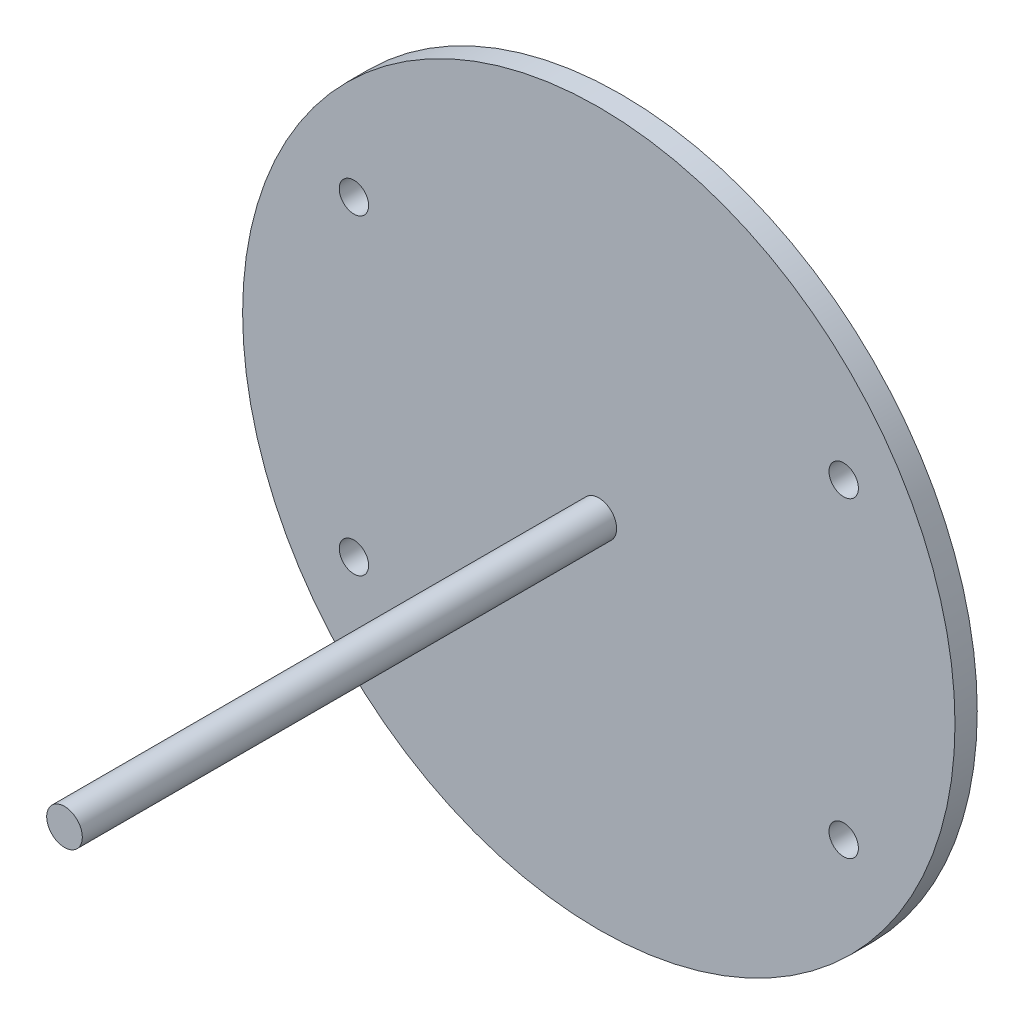
ISO-10303-21;
HEADER;
FILE_DESCRIPTION(('STEP AP214'),'2;1');
FILE_NAME('part.step','',(''),(''),'','','');
FILE_SCHEMA(('AUTOMOTIVE_DESIGN { 1 0 10303 214 1 1 1 1 }'));
ENDSEC;
DATA;
#1=APPLICATION_CONTEXT('core data for automotive mechanical design processes');
#2=APPLICATION_PROTOCOL_DEFINITION('international standard','automotive_design',2000,#1);
#3=PRODUCT_CONTEXT('',#1,'mechanical');
#4=PRODUCT('Part','Part','',(#3));
#5=PRODUCT_RELATED_PRODUCT_CATEGORY('part','',(#4));
#6=PRODUCT_DEFINITION_FORMATION('','',#4);
#7=PRODUCT_DEFINITION_CONTEXT('part definition',#1,'design');
#8=PRODUCT_DEFINITION('design','',#6,#7);
#9=PRODUCT_DEFINITION_SHAPE('','',#8);
#10=(LENGTH_UNIT() NAMED_UNIT(*) SI_UNIT(.MILLI.,.METRE.));
#11=(NAMED_UNIT(*) PLANE_ANGLE_UNIT() SI_UNIT($,.RADIAN.));
#12=(NAMED_UNIT(*) SI_UNIT($,.STERADIAN.) SOLID_ANGLE_UNIT());
#13=UNCERTAINTY_MEASURE_WITH_UNIT(LENGTH_MEASURE(1.E-05),#10,'distance_accuracy_value','');
#14=(GEOMETRIC_REPRESENTATION_CONTEXT(3) GLOBAL_UNCERTAINTY_ASSIGNED_CONTEXT((#13)) GLOBAL_UNIT_ASSIGNED_CONTEXT((#10,
#11,#12)) REPRESENTATION_CONTEXT('',''));
#15=CARTESIAN_POINT('',(0.,0.,0.));
#16=DIRECTION('',(0.,0.,1.));
#17=DIRECTION('',(1.,0.,0.));
#18=AXIS2_PLACEMENT_3D('',#15,#16,#17);
#19=CARTESIAN_POINT('',(0.,0.,2.5));
#20=DIRECTION('',(0.,0.,1.));
#21=DIRECTION('',(1.,0.,0.));
#22=AXIS2_PLACEMENT_3D('',#19,#20,#21);
#23=PLANE('',#22);
#24=CARTESIAN_POINT('',(0.,0.,2.5));
#25=DIRECTION('',(0.,0.,1.));
#26=DIRECTION('',(1.,0.,0.));
#27=AXIS2_PLACEMENT_3D('',#24,#25,#26);
#28=CIRCLE('',#27,2.);
#29=CARTESIAN_POINT('',(2.,0.,2.5));
#30=VERTEX_POINT('',#29);
#31=EDGE_CURVE('E84',#30,#30,#28,.T.);
#32=ORIENTED_EDGE('',*,*,#31,.F.);
#33=EDGE_LOOP('',(#32));
#34=FACE_BOUND('',#33,.T.);
#35=CARTESIAN_POINT('',(27.5,-17.5,2.5));
#36=DIRECTION('',(0.,0.,1.));
#37=DIRECTION('',(1.,0.,0.));
#38=AXIS2_PLACEMENT_3D('',#35,#36,#37);
#39=CIRCLE('',#38,1.65);
#40=CARTESIAN_POINT('',(29.15,-17.5,2.5));
#41=VERTEX_POINT('',#40);
#42=EDGE_CURVE('E64',#41,#41,#39,.T.);
#43=ORIENTED_EDGE('',*,*,#42,.F.);
#44=EDGE_LOOP('',(#43));
#45=FACE_BOUND('',#44,.T.);
#46=CARTESIAN_POINT('',(-27.5,17.5,2.5));
#47=DIRECTION('',(0.,0.,1.));
#48=DIRECTION('',(1.,0.,0.));
#49=AXIS2_PLACEMENT_3D('',#46,#47,#48);
#50=CIRCLE('',#49,1.65);
#51=CARTESIAN_POINT('',(-25.85,17.5,2.5));
#52=VERTEX_POINT('',#51);
#53=EDGE_CURVE('E50',#52,#52,#50,.T.);
#54=ORIENTED_EDGE('',*,*,#53,.F.);
#55=EDGE_LOOP('',(#54));
#56=FACE_BOUND('',#55,.T.);
#57=CARTESIAN_POINT('',(0.,0.,2.5));
#58=DIRECTION('',(0.,0.,1.));
#59=DIRECTION('',(1.,0.,0.));
#60=AXIS2_PLACEMENT_3D('',#57,#58,#59);
#61=CIRCLE('',#60,40.);
#62=CARTESIAN_POINT('',(40.,0.,2.5));
#63=VERTEX_POINT('',#62);
#64=EDGE_CURVE('E10',#63,#63,#61,.T.);
#65=ORIENTED_EDGE('',*,*,#64,.T.);
#66=EDGE_LOOP('',(#65));
#67=FACE_BOUND('',#66,.T.);
#68=CARTESIAN_POINT('',(27.5,17.5,2.5));
#69=DIRECTION('',(0.,0.,1.));
#70=DIRECTION('',(1.,0.,0.));
#71=AXIS2_PLACEMENT_3D('',#68,#69,#70);
#72=CIRCLE('',#71,1.65);
#73=CARTESIAN_POINT('',(29.15,17.5,2.5));
#74=VERTEX_POINT('',#73);
#75=EDGE_CURVE('E56',#74,#74,#72,.T.);
#76=ORIENTED_EDGE('',*,*,#75,.F.);
#77=EDGE_LOOP('',(#76));
#78=FACE_BOUND('',#77,.T.);
#79=CARTESIAN_POINT('',(-27.5,-17.5,2.5));
#80=DIRECTION('',(0.,0.,1.));
#81=DIRECTION('',(1.,0.,0.));
#82=AXIS2_PLACEMENT_3D('',#79,#80,#81);
#83=CIRCLE('',#82,1.65);
#84=CARTESIAN_POINT('',(-25.85,-17.5,2.5));
#85=VERTEX_POINT('',#84);
#86=EDGE_CURVE('E72',#85,#85,#83,.T.);
#87=ORIENTED_EDGE('',*,*,#86,.F.);
#88=EDGE_LOOP('',(#87));
#89=FACE_BOUND('',#88,.T.);
#90=ADVANCED_FACE('F37',(#34,#45,#56,#67,#78,#89),#23,.T.);
#91=CARTESIAN_POINT('',(0.,0.,0.));
#92=DIRECTION('',(0.,0.,1.));
#93=DIRECTION('',(1.,0.,0.));
#94=AXIS2_PLACEMENT_3D('',#91,#92,#93);
#95=PLANE('',#94);
#96=CARTESIAN_POINT('',(0.,0.,0.));
#97=DIRECTION('',(0.,0.,1.));
#98=DIRECTION('',(1.,0.,0.));
#99=AXIS2_PLACEMENT_3D('',#96,#97,#98);
#100=CIRCLE('',#99,40.);
#101=CARTESIAN_POINT('',(40.,0.,0.));
#102=VERTEX_POINT('',#101);
#103=EDGE_CURVE('E41',#102,#102,#100,.T.);
#104=ORIENTED_EDGE('',*,*,#103,.F.);
#105=EDGE_LOOP('',(#104));
#106=FACE_BOUND('',#105,.T.);
#107=CARTESIAN_POINT('',(-27.5,17.5,0.));
#108=DIRECTION('',(0.,0.,1.));
#109=DIRECTION('',(1.,0.,0.));
#110=AXIS2_PLACEMENT_3D('',#107,#108,#109);
#111=CIRCLE('',#110,1.65);
#112=CARTESIAN_POINT('',(-25.85,17.5,0.));
#113=VERTEX_POINT('',#112);
#114=EDGE_CURVE('E52',#113,#113,#111,.T.);
#115=ORIENTED_EDGE('',*,*,#114,.T.);
#116=EDGE_LOOP('',(#115));
#117=FACE_BOUND('',#116,.T.);
#118=CARTESIAN_POINT('',(27.5,17.5,0.));
#119=DIRECTION('',(0.,0.,1.));
#120=DIRECTION('',(1.,0.,0.));
#121=AXIS2_PLACEMENT_3D('',#118,#119,#120);
#122=CIRCLE('',#121,1.65);
#123=CARTESIAN_POINT('',(29.15,17.5,0.));
#124=VERTEX_POINT('',#123);
#125=EDGE_CURVE('E60',#124,#124,#122,.T.);
#126=ORIENTED_EDGE('',*,*,#125,.T.);
#127=EDGE_LOOP('',(#126));
#128=FACE_BOUND('',#127,.T.);
#129=CARTESIAN_POINT('',(27.5,-17.5,0.));
#130=DIRECTION('',(0.,0.,1.));
#131=DIRECTION('',(1.,0.,0.));
#132=AXIS2_PLACEMENT_3D('',#129,#130,#131);
#133=CIRCLE('',#132,1.65);
#134=CARTESIAN_POINT('',(29.15,-17.5,0.));
#135=VERTEX_POINT('',#134);
#136=EDGE_CURVE('E68',#135,#135,#133,.T.);
#137=ORIENTED_EDGE('',*,*,#136,.T.);
#138=EDGE_LOOP('',(#137));
#139=FACE_BOUND('',#138,.T.);
#140=CARTESIAN_POINT('',(-27.5,-17.5,0.));
#141=DIRECTION('',(0.,0.,1.));
#142=DIRECTION('',(1.,0.,0.));
#143=AXIS2_PLACEMENT_3D('',#140,#141,#142);
#144=CIRCLE('',#143,1.65);
#145=CARTESIAN_POINT('',(-25.85,-17.5,0.));
#146=VERTEX_POINT('',#145);
#147=EDGE_CURVE('E76',#146,#146,#144,.T.);
#148=ORIENTED_EDGE('',*,*,#147,.T.);
#149=EDGE_LOOP('',(#148));
#150=FACE_BOUND('',#149,.T.);
#151=ADVANCED_FACE('F103',(#106,#117,#128,#139,#150),#95,.F.);
#152=CARTESIAN_POINT('',(0.,0.,2.5));
#153=DIRECTION('',(0.,0.,-1.));
#154=DIRECTION('',(-1.,0.,0.));
#155=AXIS2_PLACEMENT_3D('',#152,#153,#154);
#156=CYLINDRICAL_SURFACE('',#155,40.);
#157=ORIENTED_EDGE('',*,*,#64,.F.);
#158=EDGE_LOOP('',(#157));
#159=FACE_BOUND('',#158,.T.);
#160=ORIENTED_EDGE('',*,*,#103,.T.);
#161=EDGE_LOOP('',(#160));
#162=FACE_BOUND('',#161,.T.);
#163=ADVANCED_FACE('F39',(#159,#162),#156,.T.);
#164=CARTESIAN_POINT('',(-27.5,17.5,2.5));
#165=DIRECTION('',(0.,0.,-1.));
#166=DIRECTION('',(-1.,0.,0.));
#167=AXIS2_PLACEMENT_3D('',#164,#165,#166);
#168=CYLINDRICAL_SURFACE('',#167,1.65);
#169=ORIENTED_EDGE('',*,*,#53,.T.);
#170=EDGE_LOOP('',(#169));
#171=FACE_BOUND('',#170,.T.);
#172=ORIENTED_EDGE('',*,*,#114,.F.);
#173=EDGE_LOOP('',(#172));
#174=FACE_BOUND('',#173,.T.);
#175=ADVANCED_FACE('F124',(#171,#174),#168,.F.);
#176=CARTESIAN_POINT('',(27.5,17.5,2.5));
#177=DIRECTION('',(0.,0.,-1.));
#178=DIRECTION('',(-1.,0.,0.));
#179=AXIS2_PLACEMENT_3D('',#176,#177,#178);
#180=CYLINDRICAL_SURFACE('',#179,1.65);
#181=ORIENTED_EDGE('',*,*,#75,.T.);
#182=EDGE_LOOP('',(#181));
#183=FACE_BOUND('',#182,.T.);
#184=ORIENTED_EDGE('',*,*,#125,.F.);
#185=EDGE_LOOP('',(#184));
#186=FACE_BOUND('',#185,.T.);
#187=ADVANCED_FACE('F131',(#183,#186),#180,.F.);
#188=CARTESIAN_POINT('',(27.5,-17.5,2.5));
#189=DIRECTION('',(0.,0.,-1.));
#190=DIRECTION('',(-1.,0.,0.));
#191=AXIS2_PLACEMENT_3D('',#188,#189,#190);
#192=CYLINDRICAL_SURFACE('',#191,1.65);
#193=ORIENTED_EDGE('',*,*,#42,.T.);
#194=EDGE_LOOP('',(#193));
#195=FACE_BOUND('',#194,.T.);
#196=ORIENTED_EDGE('',*,*,#136,.F.);
#197=EDGE_LOOP('',(#196));
#198=FACE_BOUND('',#197,.T.);
#199=ADVANCED_FACE('F115',(#195,#198),#192,.F.);
#200=CARTESIAN_POINT('',(-27.5,-17.5,2.5));
#201=DIRECTION('',(0.,0.,-1.));
#202=DIRECTION('',(-1.,0.,0.));
#203=AXIS2_PLACEMENT_3D('',#200,#201,#202);
#204=CYLINDRICAL_SURFACE('',#203,1.65);
#205=ORIENTED_EDGE('',*,*,#86,.T.);
#206=EDGE_LOOP('',(#205));
#207=FACE_BOUND('',#206,.T.);
#208=ORIENTED_EDGE('',*,*,#147,.F.);
#209=EDGE_LOOP('',(#208));
#210=FACE_BOUND('',#209,.T.);
#211=ADVANCED_FACE('F97',(#207,#210),#204,.F.);
#212=CARTESIAN_POINT('',(0.,0.,62.5));
#213=DIRECTION('',(0.,0.,-1.));
#214=DIRECTION('',(-1.,0.,0.));
#215=AXIS2_PLACEMENT_3D('',#212,#213,#214);
#216=CYLINDRICAL_SURFACE('',#215,2.);
#217=CARTESIAN_POINT('',(0.,0.,62.5));
#218=DIRECTION('',(0.,0.,1.));
#219=DIRECTION('',(1.,0.,0.));
#220=AXIS2_PLACEMENT_3D('',#217,#218,#219);
#221=CIRCLE('',#220,2.);
#222=CARTESIAN_POINT('',(2.,0.,62.5));
#223=VERTEX_POINT('',#222);
#224=EDGE_CURVE('E80',#223,#223,#221,.T.);
#225=ORIENTED_EDGE('',*,*,#224,.F.);
#226=EDGE_LOOP('',(#225));
#227=FACE_BOUND('',#226,.T.);
#228=ORIENTED_EDGE('',*,*,#31,.T.);
#229=EDGE_LOOP('',(#228));
#230=FACE_BOUND('',#229,.T.);
#231=ADVANCED_FACE('F94',(#227,#230),#216,.T.);
#232=CARTESIAN_POINT('',(0.,0.,62.5));
#233=DIRECTION('',(0.,0.,1.));
#234=DIRECTION('',(1.,0.,0.));
#235=AXIS2_PLACEMENT_3D('',#232,#233,#234);
#236=PLANE('',#235);
#237=ORIENTED_EDGE('',*,*,#224,.T.);
#238=EDGE_LOOP('',(#237));
#239=FACE_BOUND('',#238,.T.);
#240=ADVANCED_FACE('F92',(#239),#236,.T.);
#241=CLOSED_SHELL('',(#90,#151,#163,#175,#187,#199,#211,#231,#240));
#242=MANIFOLD_SOLID_BREP('B2',#241);
#243=ADVANCED_BREP_SHAPE_REPRESENTATION('',(#18,#242),#14);
#244=SHAPE_DEFINITION_REPRESENTATION(#9,#243);
ENDSEC;
END-ISO-10303-21;
